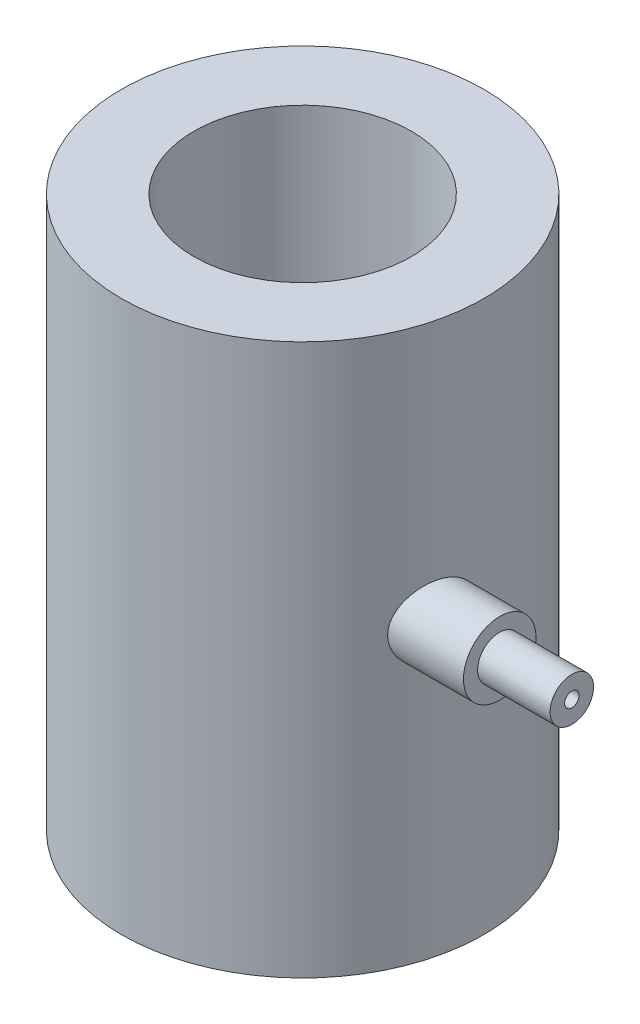
ISO-10303-21;
HEADER;
FILE_DESCRIPTION(('STEP AP214'),'2;1');
FILE_NAME('part.step','',(''),(''),'','','');
FILE_SCHEMA(('AUTOMOTIVE_DESIGN { 1 0 10303 214 1 1 1 1 }'));
ENDSEC;
DATA;
#1=APPLICATION_CONTEXT('core data for automotive mechanical design processes');
#2=APPLICATION_PROTOCOL_DEFINITION('international standard','automotive_design',2000,#1);
#3=PRODUCT_CONTEXT('',#1,'mechanical');
#4=PRODUCT('Part','Part','',(#3));
#5=PRODUCT_RELATED_PRODUCT_CATEGORY('part','',(#4));
#6=PRODUCT_DEFINITION_FORMATION('','',#4);
#7=PRODUCT_DEFINITION_CONTEXT('part definition',#1,'design');
#8=PRODUCT_DEFINITION('design','',#6,#7);
#9=PRODUCT_DEFINITION_SHAPE('','',#8);
#10=(LENGTH_UNIT() NAMED_UNIT(*) SI_UNIT(.MILLI.,.METRE.));
#11=(NAMED_UNIT(*) PLANE_ANGLE_UNIT() SI_UNIT($,.RADIAN.));
#12=(NAMED_UNIT(*) SI_UNIT($,.STERADIAN.) SOLID_ANGLE_UNIT());
#13=UNCERTAINTY_MEASURE_WITH_UNIT(LENGTH_MEASURE(1.E-05),#10,'distance_accuracy_value','');
#14=(GEOMETRIC_REPRESENTATION_CONTEXT(3) GLOBAL_UNCERTAINTY_ASSIGNED_CONTEXT((#13)) GLOBAL_UNIT_ASSIGNED_CONTEXT((#10,
#11,#12)) REPRESENTATION_CONTEXT('',''));
#15=CARTESIAN_POINT('',(0.,0.,0.));
#16=DIRECTION('',(0.,0.,1.));
#17=DIRECTION('',(1.,0.,0.));
#18=AXIS2_PLACEMENT_3D('',#15,#16,#17);
#19=CARTESIAN_POINT('',(-0.869455977426987,151.946225720153,-0.16389916679467));
#20=DIRECTION('',(0.,-1.,0.));
#21=DIRECTION('',(0.,0.,-1.));
#22=AXIS2_PLACEMENT_3D('',#19,#20,#21);
#23=CYLINDRICAL_SURFACE('',#22,87.5);
#24=CARTESIAN_POINT('',(-0.869455977426987,151.946225720153,-0.16389916679467));
#25=DIRECTION('',(0.,1.,0.));
#26=DIRECTION('',(0.,0.,1.));
#27=AXIS2_PLACEMENT_3D('',#24,#25,#26);
#28=CIRCLE('',#27,87.5);
#29=CARTESIAN_POINT('',(-0.869455977426987,151.946225720153,87.3361008332054));
#30=VERTEX_POINT('',#29);
#31=EDGE_CURVE('E56',#30,#30,#28,.T.);
#32=ORIENTED_EDGE('',*,*,#31,.F.);
#33=EDGE_LOOP('',(#32));
#34=FACE_BOUND('',#33,.T.);
#35=CARTESIAN_POINT('',(-0.869455977426987,-114.053774279847,-0.16389916679467));
#36=DIRECTION('',(0.,1.,0.));
#37=DIRECTION('',(0.,0.,1.));
#38=AXIS2_PLACEMENT_3D('',#35,#36,#37);
#39=CIRCLE('',#38,87.5);
#40=CARTESIAN_POINT('',(-0.869455977426987,-114.053774279847,87.3361008332054));
#41=VERTEX_POINT('',#40);
#42=EDGE_CURVE('E45',#41,#41,#39,.T.);
#43=ORIENTED_EDGE('',*,*,#42,.T.);
#44=EDGE_LOOP('',(#43));
#45=FACE_BOUND('',#44,.T.);
#46=CARTESIAN_POINT('',(78.0252192784344,25.7021561301574,37.676293965273));
#47=CARTESIAN_POINT('',(78.025221594585,25.2413070465486,37.6762908667244));
#48=CARTESIAN_POINT('',(78.03396905763,24.7803959254167,37.658067831766));
#49=CARTESIAN_POINT('',(78.0687697322338,23.8620554724481,37.5853802860142));
#50=CARTESIAN_POINT('',(78.0948260498474,23.4046267804338,37.5309092705577));
#51=CARTESIAN_POINT('',(78.1636928642947,22.4963551954328,37.3863044483711));
#52=CARTESIAN_POINT('',(78.2065164957635,22.045517753592,37.2961426827666));
#53=CARTESIAN_POINT('',(78.3079954333515,21.1540393805245,37.0811714526731));
#54=CARTESIAN_POINT('',(78.3666501541843,20.7133980729933,36.9563632690815));
#55=CARTESIAN_POINT('',(78.4983887376637,19.8465621790015,36.6738452406359));
#56=CARTESIAN_POINT('',(78.5714277087346,19.4203273613271,36.5162376741959));
#57=CARTESIAN_POINT('',(78.730652136754,18.5834844679913,36.1694074609994));
#58=CARTESIAN_POINT('',(78.8168376721372,18.1728764855807,35.9801846256201));
#59=CARTESIAN_POINT('',(79.0008195140143,17.3695791958093,35.571786405709));
#60=CARTESIAN_POINT('',(79.0986156669123,16.9768896515021,35.352611417406));
#61=CARTESIAN_POINT('',(79.3042153086227,16.211388134353,34.8860282435114));
#62=CARTESIAN_POINT('',(79.4120197017034,15.8385779624597,34.6386175062893));
#63=CARTESIAN_POINT('',(79.6417515489942,15.0959885929558,34.1039340746113));
#64=CARTESIAN_POINT('',(79.764120142457,14.7273505289098,33.8152659881251));
#65=CARTESIAN_POINT('',(80.016207046262,14.0157923245003,33.2107431911606));
#66=CARTESIAN_POINT('',(80.1459255476952,13.672872853336,32.8948877737254));
#67=CARTESIAN_POINT('',(80.4109008137853,13.0142428335367,32.2379381211141));
#68=CARTESIAN_POINT('',(80.5461591887497,12.698540280195,31.8968365238936));
#69=CARTESIAN_POINT('',(80.8203940599409,12.0958987052971,31.1915083612626));
#70=CARTESIAN_POINT('',(80.9593706689635,11.80896055759,30.8272810938537));
#71=CARTESIAN_POINT('',(81.2508962585574,11.2427412415423,30.0467818454793));
#72=CARTESIAN_POINT('',(81.4036187997952,10.9660462182377,29.6286954131521));
#73=CARTESIAN_POINT('',(81.7093740984169,10.4495492940933,28.7704120658107));
#74=CARTESIAN_POINT('',(81.8624068717713,10.2097493440726,28.3302139832789));
#75=CARTESIAN_POINT('',(82.1668877622683,9.76853840538226,27.430325903278));
#76=CARTESIAN_POINT('',(82.3183355501591,9.56713524900959,26.970631952309));
#77=CARTESIAN_POINT('',(82.617825096715,9.20423830515128,26.0346755041153));
#78=CARTESIAN_POINT('',(82.7658668588456,9.04274447705714,25.55841302375));
#79=CARTESIAN_POINT('',(83.0604011031307,8.75764265317397,24.5807146778026));
#80=CARTESIAN_POINT('',(83.2067711286782,8.63503694746727,24.0789489776743));
#81=CARTESIAN_POINT('',(83.4926382271319,8.4344183187772,23.0646326354465));
#82=CARTESIAN_POINT('',(83.6321351314089,8.3564064893888,22.5520817291763));
#83=CARTESIAN_POINT('',(83.9028457984302,8.24610438713092,21.5199981768605));
#84=CARTESIAN_POINT('',(84.0340609708536,8.2138063129101,21.0004667373693));
#85=CARTESIAN_POINT('',(84.287071705302,8.19575582643966,19.9583092614141));
#86=CARTESIAN_POINT('',(84.4088676580856,8.21000148225011,19.4356833542944));
#87=CARTESIAN_POINT('',(84.6380820218844,8.28422449299658,18.4096739031481));
#88=CARTESIAN_POINT('',(84.7458529561247,8.34259562789154,17.9062527323226));
#89=CARTESIAN_POINT('',(84.9512064035472,8.50326642850657,16.904357256691));
#90=CARTESIAN_POINT('',(85.048789103211,8.60556529001462,16.4058828614922));
#91=CARTESIAN_POINT('',(85.2334248797939,8.85376764097803,15.418025312014));
#92=CARTESIAN_POINT('',(85.3204801114734,8.99966218598433,14.9286403147339));
#93=CARTESIAN_POINT('',(85.4840159865046,9.33434009590771,13.9629442595318));
#94=CARTESIAN_POINT('',(85.5604969553243,9.52312214030696,13.4866327995779));
#95=CARTESIAN_POINT('',(85.7000032935457,9.93339396157384,12.5712427009859));
#96=CARTESIAN_POINT('',(85.7634656078675,10.1531299018034,12.131443625407));
#97=CARTESIAN_POINT('',(85.8812330838664,10.6294250727912,11.2709826322958));
#98=CARTESIAN_POINT('',(85.9355385237819,10.8859831842425,10.8503201335685));
#99=CARTESIAN_POINT('',(86.0355186791865,11.4341751832331,10.0314693455031));
#100=CARTESIAN_POINT('',(86.081194026241,11.725806501495,9.63327941307972));
#101=CARTESIAN_POINT('',(86.1645898983198,12.3421160264764,8.86246070261765));
#102=CARTESIAN_POINT('',(86.2023104422408,12.6667941546904,8.48983186385998));
#103=CARTESIAN_POINT('',(86.2700152010755,13.3413015437255,7.77889738161863));
#104=CARTESIAN_POINT('',(86.3001157802277,13.6906330163022,7.44013030620383));
#105=CARTESIAN_POINT('',(86.3541756275536,14.4165559088636,6.79265585811584));
#106=CARTESIAN_POINT('',(86.378134980241,14.7931469536193,6.48394807181261));
#107=CARTESIAN_POINT('',(86.420744342165,15.5709372541581,5.89885610023274));
#108=CARTESIAN_POINT('',(86.439394307703,15.9721367124462,5.62247218100665));
#109=CARTESIAN_POINT('',(86.4722084786011,16.7963117236388,5.10403636794047));
#110=CARTESIAN_POINT('',(86.4863726536902,17.2192874234714,4.86198470578762));
#111=CARTESIAN_POINT('',(86.5110391533072,18.0855028144094,4.41319352921681));
#112=CARTESIAN_POINT('',(86.5215288759666,18.5288064572156,4.20657675462636));
#113=CARTESIAN_POINT('',(86.5394964844261,19.4311992526882,3.83114429736701));
#114=CARTESIAN_POINT('',(86.5469743674986,19.8902884196497,3.66232864893142));
#115=CARTESIAN_POINT('',(86.5595347322655,20.8210220364154,3.36369761656429));
#116=CARTESIAN_POINT('',(86.5646171672681,21.292666730761,3.23388299285351));
#117=CARTESIAN_POINT('',(86.572878870724,22.2451818463828,3.01417812494575));
#118=CARTESIAN_POINT('',(86.5760581333556,22.7260522958755,2.92428800287653));
#119=CARTESIAN_POINT('',(86.5808756404358,23.6959870729819,2.7847296376195));
#120=CARTESIAN_POINT('',(86.5825063307253,24.185079841831,2.7352587271207));
#121=CARTESIAN_POINT('',(86.5843980258417,25.1656967310322,2.67762412195143));
#122=CARTESIAN_POINT('',(86.5846590259876,25.657220859688,2.66946056845192));
#123=CARTESIAN_POINT('',(86.5838442155287,26.6392199712215,2.69449911499714));
#124=CARTESIAN_POINT('',(86.5827683874334,27.1296949402885,2.72770175625875));
#125=CARTESIAN_POINT('',(86.5791464502838,28.1061095725038,2.83523732410192));
#126=CARTESIAN_POINT('',(86.5766003413459,28.5920492360114,2.90957024742588));
#127=CARTESIAN_POINT('',(86.5697390875581,29.556486922269,3.09894331333807));
#128=CARTESIAN_POINT('',(86.5654219559665,30.0349759591295,3.21402915284537));
#129=CARTESIAN_POINT('',(86.5545714357142,30.9805441224641,3.48406897000652));
#130=CARTESIAN_POINT('',(86.5480380439803,31.4476232331158,3.63902300294285));
#131=CARTESIAN_POINT('',(86.532173164777,32.3670397295445,3.98768532987825));
#132=CARTESIAN_POINT('',(86.5228416670624,32.8193770613383,4.18139376577418));
#133=CARTESIAN_POINT('',(86.5006860225027,33.7060719360657,4.60616250348157));
#134=CARTESIAN_POINT('',(86.4878618817245,34.1404295102294,4.83722274041088));
#135=CARTESIAN_POINT('',(86.4579601576259,34.9874885992633,5.33467937737022));
#136=CARTESIAN_POINT('',(86.440888226511,35.400218016571,5.60102860264551));
#137=CARTESIAN_POINT('',(86.4016499795732,36.2016786935045,6.16734021324239));
#138=CARTESIAN_POINT('',(86.3794836675188,36.5904099708822,6.46730257369927));
#139=CARTESIAN_POINT('',(86.3292046172999,37.3410678934205,7.09859444790575));
#140=CARTESIAN_POINT('',(86.3010921511407,37.7029957636747,7.42992252645487));
#141=CARTESIAN_POINT('',(86.2380827884217,38.3974756851659,8.12146137414462));
#142=CARTESIAN_POINT('',(86.2031859255805,38.7300278823887,8.48167199973309));
#143=CARTESIAN_POINT('',(86.1260260255608,39.3617423369431,9.22627872416942));
#144=CARTESIAN_POINT('',(86.0838024482251,39.6610700508653,9.61053855170051));
#145=CARTESIAN_POINT('',(85.9911825700831,40.2262600563401,10.4019978957801));
#146=CARTESIAN_POINT('',(85.9407863083303,40.4921225077967,10.8091973027051));
#147=CARTESIAN_POINT('',(85.8312636240458,40.9885938558435,11.6433929682245));
#148=CARTESIAN_POINT('',(85.7721377518137,41.2192049727533,12.0703879777752));
#149=CARTESIAN_POINT('',(85.6447449677267,41.643737409306,12.9409291167773));
#150=CARTESIAN_POINT('',(85.5764780607169,41.8376587483957,13.3844752374558));
#151=CARTESIAN_POINT('',(85.4307617277912,42.187234263617,14.2835664658961));
#152=CARTESIAN_POINT('',(85.3533367509904,42.3429870651586,14.7390772082592));
#153=CARTESIAN_POINT('',(85.1891233596284,42.6161120912715,15.6598040581164));
#154=CARTESIAN_POINT('',(85.10233498742,42.7334844894361,16.1250201217035));
#155=CARTESIAN_POINT('',(84.919550241866,42.9294257671882,17.0617835974586));
#156=CARTESIAN_POINT('',(84.8235534925896,43.0079930617562,17.5333312674371));
#157=CARTESIAN_POINT('',(84.6227135338878,43.1262154345598,18.4794055784385));
#158=CARTESIAN_POINT('',(84.5178701869025,43.1658699075997,18.9539322656773));
#159=CARTESIAN_POINT('',(84.2979570279304,43.206818991101,19.9111389138603));
#160=CARTESIAN_POINT('',(84.1827389213334,43.2074213993492,20.393814347142));
#161=CARTESIAN_POINT('',(83.9444882794865,43.1690051567499,21.3556349519934));
#162=CARTESIAN_POINT('',(83.8214556775293,43.1299861676382,21.8347800933884));
#163=CARTESIAN_POINT('',(83.5685110637937,43.013036591251,22.7865304739767));
#164=CARTESIAN_POINT('',(83.4385979734202,42.9350998869438,23.2591346730689));
#165=CARTESIAN_POINT('',(83.1730256387378,42.7412185012822,24.1948331212519));
#166=CARTESIAN_POINT('',(83.0373662377722,42.6252727831395,24.6579271105623));
#167=CARTESIAN_POINT('',(82.7557163004299,42.3507206392454,25.5912577433142));
#168=CARTESIAN_POINT('',(82.609531569363,42.1905148984374,26.060965736665));
#169=CARTESIAN_POINT('',(82.3138674536812,41.8312509258059,26.9842075493679));
#170=CARTESIAN_POINT('',(82.1643879789558,41.6321916301723,27.437740925457));
#171=CARTESIAN_POINT('',(81.8638493395066,41.1966128895785,28.3259237441646));
#172=CARTESIAN_POINT('',(81.7127901147562,40.9600920163008,28.7605724659522));
#173=CARTESIAN_POINT('',(81.4108787353382,40.4509560739181,29.608557999231));
#174=CARTESIAN_POINT('',(81.2600267092423,40.1783243112717,30.0218848303809));
#175=CARTESIAN_POINT('',(80.9551119602534,39.588025865421,30.8391191306099));
#176=CARTESIAN_POINT('',(80.8011323182942,39.2690808865172,31.2421356999408));
#177=CARTESIAN_POINT('',(80.4979845580684,38.5961633677153,32.0193823239667));
#178=CARTESIAN_POINT('',(80.348814377373,38.242206114235,32.3936248157365));
#179=CARTESIAN_POINT('',(80.0575567446857,37.5008680606312,33.1109942142026));
#180=CARTESIAN_POINT('',(79.915472837591,37.1134707916204,33.4541056165514));
#181=CARTESIAN_POINT('',(79.7096915862687,36.5092961516393,33.9430251942738));
#182=CARTESIAN_POINT('',(79.6423214827317,36.304056601615,34.1017081732749));
#183=CARTESIAN_POINT('',(79.5103092376788,35.8860706520507,34.4102457847514));
#184=CARTESIAN_POINT('',(79.4456681064854,35.6733215249113,34.5600971555721));
#185=CARTESIAN_POINT('',(79.2590035102109,35.0334442569535,34.9897082357662));
#186=CARTESIAN_POINT('',(79.1413222861141,34.5961631526745,35.2564174504523));
#187=CARTESIAN_POINT('',(78.9202143135798,33.6971068494881,35.751726361666));
#188=CARTESIAN_POINT('',(78.8167860383626,33.2353342814628,35.9803301406084));
#189=CARTESIAN_POINT('',(78.6741532666817,32.5271667099473,36.292612971266));
#190=CARTESIAN_POINT('',(78.6287145266181,32.2886553379902,36.3915595197026));
#191=CARTESIAN_POINT('',(78.5422488843718,31.8068715755716,36.5790153293637));
#192=CARTESIAN_POINT('',(78.5012207122087,31.5636005795736,36.6675275957516));
#193=CARTESIAN_POINT('',(78.3851426844397,30.8273209057064,36.9169912034058));
#194=CARTESIAN_POINT('',(78.3170541863442,30.3276230875289,37.0619676176843));
#195=CARTESIAN_POINT('',(78.220833297445,29.4859836554666,37.2658230189427));
#196=CARTESIAN_POINT('',(78.186968933662,29.1476432285173,37.3372510484837));
#197=CARTESIAN_POINT('',(78.1286078337595,28.4665513186502,37.4600369389299));
#198=CARTESIAN_POINT('',(78.1041096803444,28.1238005112316,37.511397836421));
#199=CARTESIAN_POINT('',(78.0647878798481,27.4352913967581,37.5937123922357));
#200=CARTESIAN_POINT('',(78.0499647050436,27.0895329437219,37.6246650543477));
#201=CARTESIAN_POINT('',(78.0301803728199,26.3965799399468,37.6659552500986));
#202=CARTESIAN_POINT('',(78.0252175333168,26.049385644278,37.6762962998931));
#203=CARTESIAN_POINT('',(78.0252192784344,25.7021561301574,37.676293965273));
#204=B_SPLINE_CURVE_WITH_KNOTS('',3,(#46,#47,#48,#49,#50,#51,#52,#53,#54,#55,#56,#57,#58,#59,
#60,#61,#62,#63,#64,#65,#66,#67,#68,#69,#70,#71,#72,#73,#74,#75,#76,#77,#78,#79,#80,#81,#82,#83,
#84,#85,#86,#87,#88,#89,#90,#91,#92,#93,#94,#95,#96,#97,#98,#99,#100,#101,#102,#103,#104,#105,
#106,#107,#108,#109,#110,#111,#112,#113,#114,#115,#116,#117,#118,#119,#120,#121,#122,#123,#124,
#125,#126,#127,#128,#129,#130,#131,#132,#133,#134,#135,#136,#137,#138,#139,#140,#141,#142,#143,
#144,#145,#146,#147,#148,#149,#150,#151,#152,#153,#154,#155,#156,#157,#158,#159,#160,#161,#162,
#163,#164,#165,#166,#167,#168,#169,#170,#171,#172,#173,#174,#175,#176,#177,#178,#179,#180,#181,
#182,#183,#184,#185,#186,#187,#188,#189,#190,#191,#192,#193,#194,#195,#196,#197,#198,#199,#200,
#201,#202,#203),.UNSPECIFIED.,.T.,.F.,(4,2,2,2,2,2,2,2,2,2,2,2,2,2,2,2,2,2,2,2,2,2,2,2,2,2,2,2,
2,2,2,2,2,2,2,2,2,2,2,2,2,2,2,2,2,2,2,2,2,2,2,2,2,2,2,2,2,2,2,2,2,2,2,2,2,2,2,2,2,2,2,2,2,2,2,2,
2,2,4),(0.,1.38221428055319,2.76467666496415,4.1482241715881,5.53172053449874,6.91096570054874,
8.29021909573653,9.66945424692657,11.0488141367756,12.499086195883,13.9493959780729,
15.4001303645021,16.8509088102164,18.421415285173,19.9920047718064,21.5629142901675,
23.1338222100915,24.7424322526738,26.3510817422056,27.9594566720644,29.567764842249,
31.1201897776001,32.6725862929606,34.2246645243112,35.7766949732236,37.2620405651444,
38.7473410156287,40.2325327270643,41.7177209103856,43.1786356741159,44.6395303321265,
46.1004370135897,47.5613535533424,49.0272324818777,50.4931127379311,51.9590215655494,
53.4249348773046,54.8979629389116,56.3709960346977,57.8440484031954,59.3171006550245,
60.7918099225838,62.2665212350322,63.7412379471437,65.2159520976177,66.6887143570185,
68.1614755269778,69.6341693403795,71.106855834646,72.5718439462848,74.0368250576393,
75.5017138585149,76.9666018829476,78.4276638315147,79.8887191716521,81.3498341846016,
82.8109719213368,84.2980015334551,85.7850438410724,87.2723199535184,88.7596366384187,
90.3099676965984,91.8603412087852,93.4107738471202,94.9619257460245,96.5695550193773,
98.1764854714091,99.7842118865347,100.588086569673,101.39225629985,102.966690116126,
104.540955147332,105.327262531119,106.113342895413,107.68476446454,108.726486690434,
109.768051220387,110.809666589713,111.851104253619),.UNSPECIFIED.);
#205=CARTESIAN_POINT('',(78.0252192784344,25.7021561301574,37.676293965273));
#206=VERTEX_POINT('',#205);
#207=EDGE_CURVE('E50',#206,#206,#204,.T.);
#208=ORIENTED_EDGE('',*,*,#207,.F.);
#209=EDGE_LOOP('',(#208));
#210=FACE_BOUND('',#209,.T.);
#211=ADVANCED_FACE('F41',(#34,#45,#210),#23,.T.);
#212=CARTESIAN_POINT('',(-0.869455977426987,151.946225720153,-0.16389916679467));
#213=DIRECTION('',(0.,-1.,0.));
#214=DIRECTION('',(0.,0.,-1.));
#215=AXIS2_PLACEMENT_3D('',#212,#213,#214);
#216=CYLINDRICAL_SURFACE('',#215,52.5);
#217=CARTESIAN_POINT('',(48.7903553308854,26.0964168231233,16.8699829750663));
#218=CARTESIAN_POINT('',(48.7903522605137,25.9081442647446,16.8699951303855));
#219=CARTESIAN_POINT('',(48.7851296222812,25.7197126988009,16.8852415017511));
#220=CARTESIAN_POINT('',(48.7643249324648,25.3481601381764,16.9457112503616));
#221=CARTESIAN_POINT('',(48.7487295961522,25.1650462683647,16.9909730693693));
#222=CARTESIAN_POINT('',(48.7075184951108,24.809702148768,17.1097084285618));
#223=CARTESIAN_POINT('',(48.6819172606396,24.6374565358022,17.1831410571239));
#224=CARTESIAN_POINT('',(48.6212204410466,24.308186609074,17.3555545519733));
#225=CARTESIAN_POINT('',(48.5861267376104,24.1511592869709,17.4545303546766));
#226=CARTESIAN_POINT('',(48.5063680749772,23.8531506247427,17.6768455817582));
#227=CARTESIAN_POINT('',(48.4615284624028,23.7125455689661,17.8006258560922));
#228=CARTESIAN_POINT('',(48.3636272356581,23.4541132286817,18.0672187488866));
#229=CARTESIAN_POINT('',(48.3105637919736,23.3362910257017,18.2100356013268));
#230=CARTESIAN_POINT('',(48.1943708209648,23.120186169685,18.5181598318173));
#231=CARTESIAN_POINT('',(48.1308643854622,23.0232170942368,18.6842454032441));
#232=CARTESIAN_POINT('',(47.9973228674155,22.8583733149009,19.0278155252144));
#233=CARTESIAN_POINT('',(47.9272859047425,22.7905070213424,19.205303353848));
#234=CARTESIAN_POINT('',(47.7774317278116,22.6811162434559,19.578778950085));
#235=CARTESIAN_POINT('',(47.6972745498983,22.64159890296,19.7752182531637));
#236=CARTESIAN_POINT('',(47.5331536020441,22.5964527950015,20.1703875316411));
#237=CARTESIAN_POINT('',(47.4491886347585,22.5908347625373,20.3691182126988));
#238=CARTESIAN_POINT('',(47.274438036374,22.6137069859485,20.7757105711303));
#239=CARTESIAN_POINT('',(47.1835438107116,22.644246332452,20.9834120874101));
#240=CARTESIAN_POINT('',(47.0023817292754,22.7419271490129,21.3903768048991));
#241=CARTESIAN_POINT('',(46.9121140517592,22.8090786353923,21.58963768084));
#242=CARTESIAN_POINT('',(46.7330975622968,22.980595540637,21.9786799336213));
#243=CARTESIAN_POINT('',(46.6444307864535,23.0857774411322,22.1681400093582));
#244=CARTESIAN_POINT('',(46.4742514030509,23.3313250416207,22.5266874484133));
#245=CARTESIAN_POINT('',(46.3927382175664,23.4716878958717,22.6957764578837));
#246=CARTESIAN_POINT('',(46.2805659900221,23.7028425595073,22.9257602944025));
#247=CARTESIAN_POINT('',(46.2455346933556,23.7813699170332,22.9971331173797));
#248=CARTESIAN_POINT('',(46.1785051952533,23.9453466551449,23.1329903724608));
#249=CARTESIAN_POINT('',(46.1465053751619,24.0307922959937,23.1974784830156));
#250=CARTESIAN_POINT('',(46.0860106423822,24.2080787927922,23.3188340714897));
#251=CARTESIAN_POINT('',(46.0575152724789,24.2999188120331,23.3757025436069));
#252=CARTESIAN_POINT('',(46.0045073167488,24.4893058700257,23.4810800646821));
#253=CARTESIAN_POINT('',(45.9799923266501,24.5868494148732,23.5295941610221));
#254=CARTESIAN_POINT('',(45.9376491136521,24.7766955327576,23.6131249982469));
#255=CARTESIAN_POINT('',(45.9193941821052,24.8685203341044,23.6490131144548));
#256=CARTESIAN_POINT('',(45.8867450064622,25.0554464764949,23.7130554691044));
#257=CARTESIAN_POINT('',(45.872348678873,25.1505460178759,23.741213881479));
#258=CARTESIAN_POINT('',(45.84765827103,25.3432598962078,23.78942985269));
#259=CARTESIAN_POINT('',(45.8373625704856,25.440873223616,23.8094906112143));
#260=CARTESIAN_POINT('',(45.8210533439701,25.637803714184,23.8412390325639));
#261=CARTESIAN_POINT('',(45.815039476353,25.7371207407584,23.8529273634231));
#262=CARTESIAN_POINT('',(45.8077809378653,25.9267507459639,23.8670310692022));
#263=CARTESIAN_POINT('',(45.8061257542778,26.0169896841076,23.8702446670857));
#264=CARTESIAN_POINT('',(45.8064124613546,26.1974721975465,23.8696878701469));
#265=CARTESIAN_POINT('',(45.808355570285,26.2877157640643,23.8659151099684));
#266=CARTESIAN_POINT('',(45.8158110281484,26.4674484641321,23.851427447706));
#267=CARTESIAN_POINT('',(45.8213213937304,26.5569379889294,23.8407164032211));
#268=CARTESIAN_POINT('',(45.8358207584216,26.7345624607155,23.8124927269482));
#269=CARTESIAN_POINT('',(45.844811059233,26.8226968879757,23.7949775500023));
#270=CARTESIAN_POINT('',(45.8762617720343,27.079523943011,23.7335903685824));
#271=CARTESIAN_POINT('',(45.9034189875262,27.245543011925,23.6804601025977));
#272=CARTESIAN_POINT('',(45.9690518489416,27.5658707440649,23.5512728053951));
#273=CARTESIAN_POINT('',(46.0075295218914,27.7201773038338,23.4752116681448));
#274=CARTESIAN_POINT('',(46.0964626980742,28.0222327899382,23.2980447783268));
#275=CARTESIAN_POINT('',(46.1474646554502,28.1691418333347,23.1957828944231));
#276=CARTESIAN_POINT('',(46.2579511180325,28.4438780590397,22.9720697145928));
#277=CARTESIAN_POINT('',(46.3174388788476,28.5716978789951,22.8506110518133));
#278=CARTESIAN_POINT('',(46.4490398620633,28.818103251126,22.5788995870767));
#279=CARTESIAN_POINT('',(46.5218205168906,28.9344981692439,22.4269833937002));
#280=CARTESIAN_POINT('',(46.6725034472072,29.1402456231107,22.108128543642));
#281=CARTESIAN_POINT('',(46.7504079216174,29.2295864550251,21.9411834257154));
#282=CARTESIAN_POINT('',(46.9164260432226,29.3869885230962,21.5801225135522));
#283=CARTESIAN_POINT('',(47.0048141617288,29.4522875952028,21.3849248372264));
#284=CARTESIAN_POINT('',(47.1822253396643,29.5478064098556,20.986361564392));
#285=CARTESIAN_POINT('',(47.2712485886895,29.5780151953394,20.7829934371293));
#286=CARTESIAN_POINT('',(47.4512995379215,29.6029605694958,20.3643430943885));
#287=CARTESIAN_POINT('',(47.5422451157811,29.596091248274,20.1489283094531));
#288=CARTESIAN_POINT('',(47.7195779330472,29.5424632704381,19.7210022573837));
#289=CARTESIAN_POINT('',(47.8059652971876,29.4957057059546,19.5084909109162));
#290=CARTESIAN_POINT('',(47.929366461614,29.3965948470851,19.1993926043459));
#291=CARTESIAN_POINT('',(47.9691169070506,29.3592219374554,19.0988920806668));
#292=CARTESIAN_POINT('',(48.0466548902856,29.2750949750733,18.901129828365));
#293=CARTESIAN_POINT('',(48.0844433176544,29.2283452213333,18.8038666392573));
#294=CARTESIAN_POINT('',(48.1578048867414,29.125646910279,18.6134307865508));
#295=CARTESIAN_POINT('',(48.1933776985892,29.0696969876967,18.5202587326639));
#296=CARTESIAN_POINT('',(48.2620410417837,28.9489169132017,18.3389489885876));
#297=CARTESIAN_POINT('',(48.2951328095419,28.8840912306018,18.2508087960991));
#298=CARTESIAN_POINT('',(48.3566606439802,28.7501884143132,18.0856686700134));
#299=CARTESIAN_POINT('',(48.3852579183893,28.6816188433834,18.0083169569392));
#300=CARTESIAN_POINT('',(48.4398824876061,28.5374300155223,17.8595692893981));
#301=CARTESIAN_POINT('',(48.4659110403715,28.4618142448954,17.7881704223806));
#302=CARTESIAN_POINT('',(48.5152564633595,28.3039745564118,17.6519765542463));
#303=CARTESIAN_POINT('',(48.5385722588883,28.2217480412901,17.5871841716218));
#304=CARTESIAN_POINT('',(48.5823196494473,28.0513427406667,17.464943726096));
#305=CARTESIAN_POINT('',(48.6027526358612,27.9631668572074,17.4074921214508));
#306=CARTESIAN_POINT('',(48.6393459495558,27.7875982234392,17.3041097484444));
#307=CARTESIAN_POINT('',(48.6557007234287,27.7005481219533,17.2576652281554));
#308=CARTESIAN_POINT('',(48.685695509373,27.5224915171123,17.1721619244663));
#309=CARTESIAN_POINT('',(48.6993367857883,27.4314868805568,17.1330997017377));
#310=CARTESIAN_POINT('',(48.7238200870441,27.2462793274432,17.062776534598));
#311=CARTESIAN_POINT('',(48.7346656568123,27.1520806342215,17.0315057124689));
#312=CARTESIAN_POINT('',(48.753515262545,26.9611401995295,16.9770329708044));
#313=CARTESIAN_POINT('',(48.7615202656862,26.8643993357092,16.9538283049005));
#314=CARTESIAN_POINT('',(48.7754893983292,26.656567898085,16.9132764296436));
#315=CARTESIAN_POINT('',(48.781060586968,26.5452269786465,16.8970607610368));
#316=CARTESIAN_POINT('',(48.7884944312841,26.3214152316825,16.8754105161103));
#317=CARTESIAN_POINT('',(48.7903571659992,26.2089444282893,16.8699757100194));
#318=CARTESIAN_POINT('',(48.7903553308854,26.0964168231233,16.8699829750663));
#319=B_SPLINE_CURVE_WITH_KNOTS('',3,(#217,#218,#219,#220,#221,#222,#223,#224,#225,#226,#227,
#228,#229,#230,#231,#232,#233,#234,#235,#236,#237,#238,#239,#240,#241,#242,#243,#244,#245,#246,
#247,#248,#249,#250,#251,#252,#253,#254,#255,#256,#257,#258,#259,#260,#261,#262,#263,#264,#265,
#266,#267,#268,#269,#270,#271,#272,#273,#274,#275,#276,#277,#278,#279,#280,#281,#282,#283,#284,
#285,#286,#287,#288,#289,#290,#291,#292,#293,#294,#295,#296,#297,#298,#299,#300,#301,#302,#303,
#304,#305,#306,#307,#308,#309,#310,#311,#312,#313,#314,#315,#316,#317,#318),.UNSPECIFIED.,.T.,
.F.,(4,2,2,2,2,2,2,2,2,2,2,2,2,2,2,2,2,2,2,2,2,2,2,2,2,2,2,2,2,2,2,2,2,2,2,2,2,2,2,2,2,2,2,2,2,
2,2,2,2,2,4),(0.,0.564413084041342,1.12955042999518,1.69387013202272,2.25807805122293,
2.83338151847458,3.40881315478949,4.01378493856888,4.61893143378081,5.26355334966259,
5.9083793892453,6.59156809536574,7.27494380159827,7.97395875258543,8.67291717938513,
9.00778526910445,9.34247353629429,9.67711809129735,10.0115597525798,10.311945292673,
10.6121683082308,10.9122725779755,11.2123528998138,11.4829510513497,11.7536408354653,
12.0241802484848,12.2948209572371,12.8215151147513,13.3483036388973,13.9043429688323,
14.4605962018686,15.0722988629425,15.6842657751304,16.3533142939223,17.0225716693,
17.7210419715006,18.4194931503648,18.7621942873613,19.104738663446,19.4473339176806,
19.7897572911456,20.1110961038412,20.432276760926,20.7535842277164,21.0747360814712,
21.3743912297151,21.6739064260058,21.9730399508676,22.272071526625,22.6094197141999,
22.9467607118392),.UNSPECIFIED.);
#320=CARTESIAN_POINT('',(48.7903553308854,26.0964168231233,16.8699829750663));
#321=VERTEX_POINT('',#320);
#322=EDGE_CURVE('E88',#321,#321,#319,.T.);
#323=ORIENTED_EDGE('',*,*,#322,.F.);
#324=EDGE_LOOP('',(#323));
#325=FACE_BOUND('',#324,.T.);
#326=CARTESIAN_POINT('',(-0.869455977426987,-114.053774279847,-0.16389916679467));
#327=DIRECTION('',(0.,1.,0.));
#328=DIRECTION('',(0.,0.,1.));
#329=AXIS2_PLACEMENT_3D('',#326,#327,#328);
#330=CIRCLE('',#329,52.5);
#331=CARTESIAN_POINT('',(-0.869455977426987,-114.053774279847,52.3361008332053));
#332=VERTEX_POINT('',#331);
#333=EDGE_CURVE('E65',#332,#332,#330,.T.);
#334=ORIENTED_EDGE('',*,*,#333,.F.);
#335=EDGE_LOOP('',(#334));
#336=FACE_BOUND('',#335,.T.);
#337=CARTESIAN_POINT('',(-0.869455977426987,151.946225720153,-0.16389916679467));
#338=DIRECTION('',(0.,1.,0.));
#339=DIRECTION('',(0.,0.,1.));
#340=AXIS2_PLACEMENT_3D('',#337,#338,#339);
#341=CIRCLE('',#340,52.5);
#342=CARTESIAN_POINT('',(-0.869455977426987,151.946225720153,52.3361008332053));
#343=VERTEX_POINT('',#342);
#344=EDGE_CURVE('E71',#343,#343,#341,.T.);
#345=ORIENTED_EDGE('',*,*,#344,.T.);
#346=EDGE_LOOP('',(#345));
#347=FACE_BOUND('',#346,.T.);
#348=ADVANCED_FACE('F82',(#325,#336,#347),#216,.F.);
#349=CARTESIAN_POINT('',(-0.869455977426987,151.946225720153,-0.16389916679467));
#350=DIRECTION('',(0.,1.,0.));
#351=DIRECTION('',(0.,0.,1.));
#352=AXIS2_PLACEMENT_3D('',#349,#350,#351);
#353=PLANE('',#352);
#354=ORIENTED_EDGE('',*,*,#31,.T.);
#355=EDGE_LOOP('',(#354));
#356=FACE_BOUND('',#355,.T.);
#357=ORIENTED_EDGE('',*,*,#344,.F.);
#358=EDGE_LOOP('',(#357));
#359=FACE_BOUND('',#358,.T.);
#360=ADVANCED_FACE('F86',(#356,#359),#353,.T.);
#361=CARTESIAN_POINT('',(-0.869455977426987,-114.053774279847,-0.16389916679467));
#362=DIRECTION('',(0.,1.,0.));
#363=DIRECTION('',(0.,0.,1.));
#364=AXIS2_PLACEMENT_3D('',#361,#362,#363);
#365=PLANE('',#364);
#366=ORIENTED_EDGE('',*,*,#42,.F.);
#367=EDGE_LOOP('',(#366));
#368=FACE_BOUND('',#367,.T.);
#369=ORIENTED_EDGE('',*,*,#333,.T.);
#370=EDGE_LOOP('',(#369));
#371=FACE_BOUND('',#370,.T.);
#372=ADVANCED_FACE('F79',(#368,#371),#365,.F.);
#373=CARTESIAN_POINT('',(114.630544022573,25.7021561301574,20.176293965273));
#374=DIRECTION('',(-1.,0.,0.));
#375=DIRECTION('',(0.,0.,1.));
#376=AXIS2_PLACEMENT_3D('',#373,#374,#375);
#377=CYLINDRICAL_SURFACE('',#376,17.5);
#378=CARTESIAN_POINT('',(114.630544022573,25.7021561301574,20.176293965273));
#379=DIRECTION('',(1.,0.,0.));
#380=DIRECTION('',(0.,0.,-1.));
#381=AXIS2_PLACEMENT_3D('',#378,#379,#380);
#382=CIRCLE('',#381,17.5);
#383=CARTESIAN_POINT('',(114.630544022573,25.7021561301574,2.67629396527302));
#384=VERTEX_POINT('',#383);
#385=EDGE_CURVE('E62',#384,#384,#382,.T.);
#386=ORIENTED_EDGE('',*,*,#385,.F.);
#387=EDGE_LOOP('',(#386));
#388=FACE_BOUND('',#387,.T.);
#389=ORIENTED_EDGE('',*,*,#207,.T.);
#390=EDGE_LOOP('',(#389));
#391=FACE_BOUND('',#390,.T.);
#392=ADVANCED_FACE('F73',(#388,#391),#377,.T.);
#393=CARTESIAN_POINT('',(114.630544022573,25.7021561301574,20.176293965273));
#394=DIRECTION('',(1.,0.,0.));
#395=DIRECTION('',(0.,0.,-1.));
#396=AXIS2_PLACEMENT_3D('',#393,#394,#395);
#397=PLANE('',#396);
#398=CARTESIAN_POINT('',(114.630544022573,26.0964168231233,20.3699829750663));
#399=DIRECTION('',(1.,0.,0.));
#400=DIRECTION('',(0.,0.,-1.));
#401=AXIS2_PLACEMENT_3D('',#398,#399,#400);
#402=CIRCLE('',#401,10.5);
#403=CARTESIAN_POINT('',(114.630544022573,26.0964168231233,9.86998297506626));
#404=VERTEX_POINT('',#403);
#405=EDGE_CURVE('E10',#404,#404,#402,.T.);
#406=ORIENTED_EDGE('',*,*,#405,.F.);
#407=EDGE_LOOP('',(#406));
#408=FACE_BOUND('',#407,.T.);
#409=ORIENTED_EDGE('',*,*,#385,.T.);
#410=EDGE_LOOP('',(#409));
#411=FACE_BOUND('',#410,.T.);
#412=ADVANCED_FACE('F78',(#408,#411),#397,.T.);
#413=CARTESIAN_POINT('',(149.630544022573,26.0964168231233,20.3699829750663));
#414=DIRECTION('',(-1.,0.,0.));
#415=DIRECTION('',(0.,0.,1.));
#416=AXIS2_PLACEMENT_3D('',#413,#414,#415);
#417=CYLINDRICAL_SURFACE('',#416,10.5);
#418=CARTESIAN_POINT('',(149.630544022573,26.0964168231233,20.3699829750663));
#419=DIRECTION('',(1.,0.,0.));
#420=DIRECTION('',(0.,0.,-1.));
#421=AXIS2_PLACEMENT_3D('',#418,#419,#420);
#422=CIRCLE('',#421,10.5);
#423=CARTESIAN_POINT('',(149.630544022573,26.0964168231233,9.86998297506626));
#424=VERTEX_POINT('',#423);
#425=EDGE_CURVE('E60',#424,#424,#422,.T.);
#426=ORIENTED_EDGE('',*,*,#425,.F.);
#427=EDGE_LOOP('',(#426));
#428=FACE_BOUND('',#427,.T.);
#429=ORIENTED_EDGE('',*,*,#405,.T.);
#430=EDGE_LOOP('',(#429));
#431=FACE_BOUND('',#430,.T.);
#432=ADVANCED_FACE('F104',(#428,#431),#417,.T.);
#433=CARTESIAN_POINT('',(149.630544022573,26.0964168231233,20.3699829750663));
#434=DIRECTION('',(1.,0.,0.));
#435=DIRECTION('',(0.,0.,-1.));
#436=AXIS2_PLACEMENT_3D('',#433,#434,#435);
#437=PLANE('',#436);
#438=CARTESIAN_POINT('',(149.630544022573,26.0964168231233,20.3699829750663));
#439=DIRECTION('',(1.,0.,0.));
#440=DIRECTION('',(0.,0.,-1.));
#441=AXIS2_PLACEMENT_3D('',#438,#439,#440);
#442=CIRCLE('',#441,3.5);
#443=CARTESIAN_POINT('',(149.630544022573,26.0964168231233,16.8699829750663));
#444=VERTEX_POINT('',#443);
#445=EDGE_CURVE('E96',#444,#444,#442,.T.);
#446=ORIENTED_EDGE('',*,*,#445,.F.);
#447=EDGE_LOOP('',(#446));
#448=FACE_BOUND('',#447,.T.);
#449=ORIENTED_EDGE('',*,*,#425,.T.);
#450=EDGE_LOOP('',(#449));
#451=FACE_BOUND('',#450,.T.);
#452=ADVANCED_FACE('F101',(#448,#451),#437,.T.);
#453=CARTESIAN_POINT('',(-4.36945597742697,26.0964168231233,20.3699829750663));
#454=DIRECTION('',(1.,0.,0.));
#455=DIRECTION('',(0.,0.,-1.));
#456=AXIS2_PLACEMENT_3D('',#453,#454,#455);
#457=CYLINDRICAL_SURFACE('',#456,3.5);
#458=ORIENTED_EDGE('',*,*,#322,.T.);
#459=EDGE_LOOP('',(#458));
#460=FACE_BOUND('',#459,.T.);
#461=ORIENTED_EDGE('',*,*,#445,.T.);
#462=EDGE_LOOP('',(#461));
#463=FACE_BOUND('',#462,.T.);
#464=ADVANCED_FACE('F97',(#460,#463),#457,.F.);
#465=CLOSED_SHELL('',(#211,#348,#360,#372,#392,#412,#432,#452,#464));
#466=MANIFOLD_SOLID_BREP('B2',#465);
#467=ADVANCED_BREP_SHAPE_REPRESENTATION('',(#18,#466),#14);
#468=SHAPE_DEFINITION_REPRESENTATION(#9,#467);
ENDSEC;
END-ISO-10303-21;
